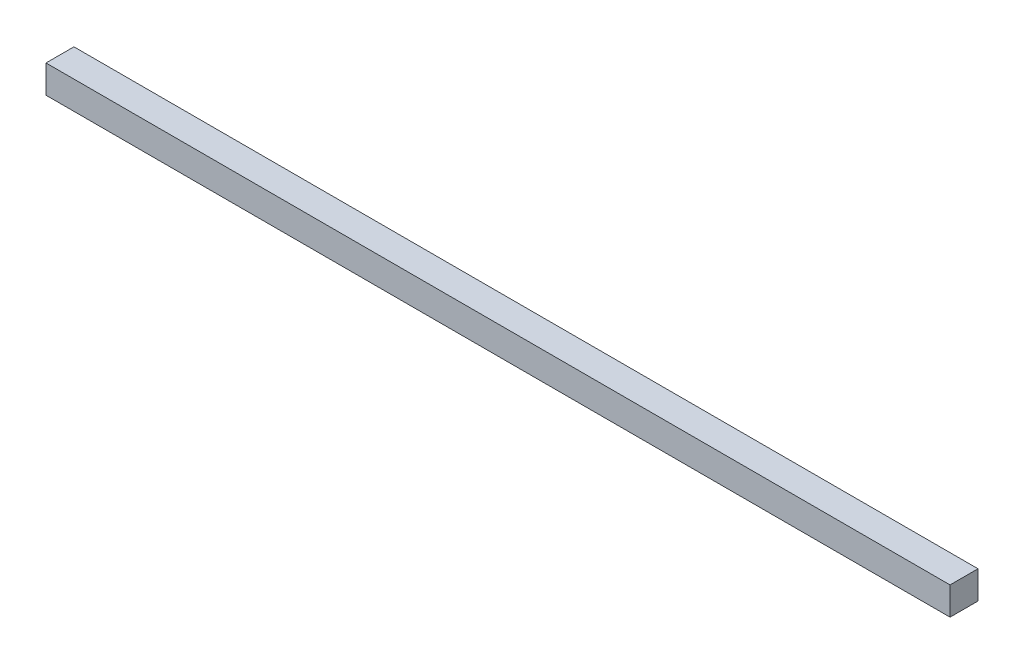
ISO-10303-21;
HEADER;
FILE_DESCRIPTION(('STEP AP214'),'2;1');
FILE_NAME('part.step','',(''),(''),'','','');
FILE_SCHEMA(('AUTOMOTIVE_DESIGN { 1 0 10303 214 1 1 1 1 }'));
ENDSEC;
DATA;
#1=APPLICATION_CONTEXT('core data for automotive mechanical design processes');
#2=APPLICATION_PROTOCOL_DEFINITION('international standard','automotive_design',2000,#1);
#3=PRODUCT_CONTEXT('',#1,'mechanical');
#4=PRODUCT('Part','Part','',(#3));
#5=PRODUCT_RELATED_PRODUCT_CATEGORY('part','',(#4));
#6=PRODUCT_DEFINITION_FORMATION('','',#4);
#7=PRODUCT_DEFINITION_CONTEXT('part definition',#1,'design');
#8=PRODUCT_DEFINITION('design','',#6,#7);
#9=PRODUCT_DEFINITION_SHAPE('','',#8);
#10=(LENGTH_UNIT() NAMED_UNIT(*) SI_UNIT(.MILLI.,.METRE.));
#11=(NAMED_UNIT(*) PLANE_ANGLE_UNIT() SI_UNIT($,.RADIAN.));
#12=(NAMED_UNIT(*) SI_UNIT($,.STERADIAN.) SOLID_ANGLE_UNIT());
#13=UNCERTAINTY_MEASURE_WITH_UNIT(LENGTH_MEASURE(1.E-05),#10,'distance_accuracy_value','');
#14=(GEOMETRIC_REPRESENTATION_CONTEXT(3) GLOBAL_UNCERTAINTY_ASSIGNED_CONTEXT((#13)) GLOBAL_UNIT_ASSIGNED_CONTEXT((#10,
#11,#12)) REPRESENTATION_CONTEXT('',''));
#15=CARTESIAN_POINT('',(0.,0.,0.));
#16=DIRECTION('',(0.,0.,1.));
#17=DIRECTION('',(1.,0.,0.));
#18=AXIS2_PLACEMENT_3D('',#15,#16,#17);
#19=CARTESIAN_POINT('',(-307.975,0.,0.));
#20=DIRECTION('',(0.,-1.,0.));
#21=DIRECTION('',(0.,0.,-1.));
#22=AXIS2_PLACEMENT_3D('',#19,#20,#21);
#23=PLANE('',#22);
#24=DIRECTION('',(0.,0.,-1.));
#25=VECTOR('',#24,1.);
#26=CARTESIAN_POINT('',(0.,0.,0.));
#27=LINE('',#26,#25);
#28=CARTESIAN_POINT('',(0.,0.,0.));
#29=VERTEX_POINT('',#28);
#30=CARTESIAN_POINT('',(0.,0.,-9.525));
#31=VERTEX_POINT('',#30);
#32=EDGE_CURVE('E110',#29,#31,#27,.T.);
#33=ORIENTED_EDGE('',*,*,#32,.F.);
#34=DIRECTION('',(1.,0.,0.));
#35=VECTOR('',#34,1.);
#36=CARTESIAN_POINT('',(-307.975,0.,0.));
#37=LINE('',#36,#35);
#38=CARTESIAN_POINT('',(-307.975,0.,0.));
#39=VERTEX_POINT('',#38);
#40=EDGE_CURVE('E11',#39,#29,#37,.T.);
#41=ORIENTED_EDGE('',*,*,#40,.F.);
#42=DIRECTION('',(0.,0.,-1.));
#43=VECTOR('',#42,1.);
#44=CARTESIAN_POINT('',(-307.975,0.,0.));
#45=LINE('',#44,#43);
#46=CARTESIAN_POINT('',(-307.975,0.,-9.525));
#47=VERTEX_POINT('',#46);
#48=EDGE_CURVE('E105',#39,#47,#45,.T.);
#49=ORIENTED_EDGE('',*,*,#48,.T.);
#50=DIRECTION('',(1.,0.,0.));
#51=VECTOR('',#50,1.);
#52=CARTESIAN_POINT('',(-307.975,0.,-9.525));
#53=LINE('',#52,#51);
#54=EDGE_CURVE('E48',#47,#31,#53,.T.);
#55=ORIENTED_EDGE('',*,*,#54,.T.);
#56=EDGE_LOOP('',(#33,#41,#49,#55));
#57=FACE_BOUND('',#56,.T.);
#58=ADVANCED_FACE('F45',(#57),#23,.T.);
#59=CARTESIAN_POINT('',(-307.975,0.,0.));
#60=DIRECTION('',(0.,0.,-1.));
#61=DIRECTION('',(-1.,0.,0.));
#62=AXIS2_PLACEMENT_3D('',#59,#60,#61);
#63=PLANE('',#62);
#64=DIRECTION('',(0.,1.,0.));
#65=VECTOR('',#64,1.);
#66=CARTESIAN_POINT('',(0.,0.,0.));
#67=LINE('',#66,#65);
#68=CARTESIAN_POINT('',(0.,9.525,0.));
#69=VERTEX_POINT('',#68);
#70=EDGE_CURVE('E78',#29,#69,#67,.T.);
#71=ORIENTED_EDGE('',*,*,#70,.T.);
#72=DIRECTION('',(1.,0.,0.));
#73=VECTOR('',#72,1.);
#74=CARTESIAN_POINT('',(-307.975,9.525,0.));
#75=LINE('',#74,#73);
#76=CARTESIAN_POINT('',(-307.975,9.525,0.));
#77=VERTEX_POINT('',#76);
#78=EDGE_CURVE('E54',#77,#69,#75,.T.);
#79=ORIENTED_EDGE('',*,*,#78,.F.);
#80=DIRECTION('',(0.,1.,0.));
#81=VECTOR('',#80,1.);
#82=CARTESIAN_POINT('',(-307.975,0.,0.));
#83=LINE('',#82,#81);
#84=EDGE_CURVE('E95',#39,#77,#83,.T.);
#85=ORIENTED_EDGE('',*,*,#84,.F.);
#86=ORIENTED_EDGE('',*,*,#40,.T.);
#87=EDGE_LOOP('',(#71,#79,#85,#86));
#88=FACE_BOUND('',#87,.T.);
#89=ADVANCED_FACE('F120',(#88),#63,.F.);
#90=CARTESIAN_POINT('',(-307.975,9.525,0.));
#91=DIRECTION('',(0.,-1.,0.));
#92=DIRECTION('',(0.,0.,-1.));
#93=AXIS2_PLACEMENT_3D('',#90,#91,#92);
#94=PLANE('',#93);
#95=DIRECTION('',(0.,0.,-1.));
#96=VECTOR('',#95,1.);
#97=CARTESIAN_POINT('',(0.,9.525,0.));
#98=LINE('',#97,#96);
#99=CARTESIAN_POINT('',(0.,9.525,-9.525));
#100=VERTEX_POINT('',#99);
#101=EDGE_CURVE('E102',#69,#100,#98,.T.);
#102=ORIENTED_EDGE('',*,*,#101,.T.);
#103=DIRECTION('',(1.,0.,0.));
#104=VECTOR('',#103,1.);
#105=CARTESIAN_POINT('',(-307.975,9.525,-9.525));
#106=LINE('',#105,#104);
#107=CARTESIAN_POINT('',(-307.975,9.525,-9.525));
#108=VERTEX_POINT('',#107);
#109=EDGE_CURVE('E99',#108,#100,#106,.T.);
#110=ORIENTED_EDGE('',*,*,#109,.F.);
#111=DIRECTION('',(0.,0.,-1.));
#112=VECTOR('',#111,1.);
#113=CARTESIAN_POINT('',(-307.975,9.525,0.));
#114=LINE('',#113,#112);
#115=EDGE_CURVE('E90',#77,#108,#114,.T.);
#116=ORIENTED_EDGE('',*,*,#115,.F.);
#117=ORIENTED_EDGE('',*,*,#78,.T.);
#118=EDGE_LOOP('',(#102,#110,#116,#117));
#119=FACE_BOUND('',#118,.T.);
#120=ADVANCED_FACE('F100',(#119),#94,.F.);
#121=CARTESIAN_POINT('',(-307.975,0.,-9.525));
#122=DIRECTION('',(0.,0.,-1.));
#123=DIRECTION('',(-1.,0.,0.));
#124=AXIS2_PLACEMENT_3D('',#121,#122,#123);
#125=PLANE('',#124);
#126=DIRECTION('',(0.,1.,0.));
#127=VECTOR('',#126,1.);
#128=CARTESIAN_POINT('',(0.,0.,-9.525));
#129=LINE('',#128,#127);
#130=EDGE_CURVE('E113',#31,#100,#129,.T.);
#131=ORIENTED_EDGE('',*,*,#130,.F.);
#132=ORIENTED_EDGE('',*,*,#54,.F.);
#133=DIRECTION('',(0.,1.,0.));
#134=VECTOR('',#133,1.);
#135=CARTESIAN_POINT('',(-307.975,0.,-9.525));
#136=LINE('',#135,#134);
#137=EDGE_CURVE('E94',#47,#108,#136,.T.);
#138=ORIENTED_EDGE('',*,*,#137,.T.);
#139=ORIENTED_EDGE('',*,*,#109,.T.);
#140=EDGE_LOOP('',(#131,#132,#138,#139));
#141=FACE_BOUND('',#140,.T.);
#142=ADVANCED_FACE('F104',(#141),#125,.T.);
#143=CARTESIAN_POINT('',(-307.975,0.,0.));
#144=DIRECTION('',(1.,0.,0.));
#145=DIRECTION('',(0.,0.,-1.));
#146=AXIS2_PLACEMENT_3D('',#143,#144,#145);
#147=PLANE('',#146);
#148=ORIENTED_EDGE('',*,*,#48,.F.);
#149=ORIENTED_EDGE('',*,*,#84,.T.);
#150=ORIENTED_EDGE('',*,*,#115,.T.);
#151=ORIENTED_EDGE('',*,*,#137,.F.);
#152=EDGE_LOOP('',(#148,#149,#150,#151));
#153=FACE_BOUND('',#152,.T.);
#154=ADVANCED_FACE('F93',(#153),#147,.F.);
#155=CARTESIAN_POINT('',(0.,0.,0.));
#156=DIRECTION('',(1.,0.,0.));
#157=DIRECTION('',(0.,0.,-1.));
#158=AXIS2_PLACEMENT_3D('',#155,#156,#157);
#159=PLANE('',#158);
#160=ORIENTED_EDGE('',*,*,#32,.T.);
#161=ORIENTED_EDGE('',*,*,#130,.T.);
#162=ORIENTED_EDGE('',*,*,#101,.F.);
#163=ORIENTED_EDGE('',*,*,#70,.F.);
#164=EDGE_LOOP('',(#160,#161,#162,#163));
#165=FACE_BOUND('',#164,.T.);
#166=ADVANCED_FACE('F118',(#165),#159,.T.);
#167=CLOSED_SHELL('',(#58,#89,#120,#142,#154,#166));
#168=MANIFOLD_SOLID_BREP('B2',#167);
#169=ADVANCED_BREP_SHAPE_REPRESENTATION('',(#18,#168),#14);
#170=SHAPE_DEFINITION_REPRESENTATION(#9,#169);
ENDSEC;
END-ISO-10303-21;
